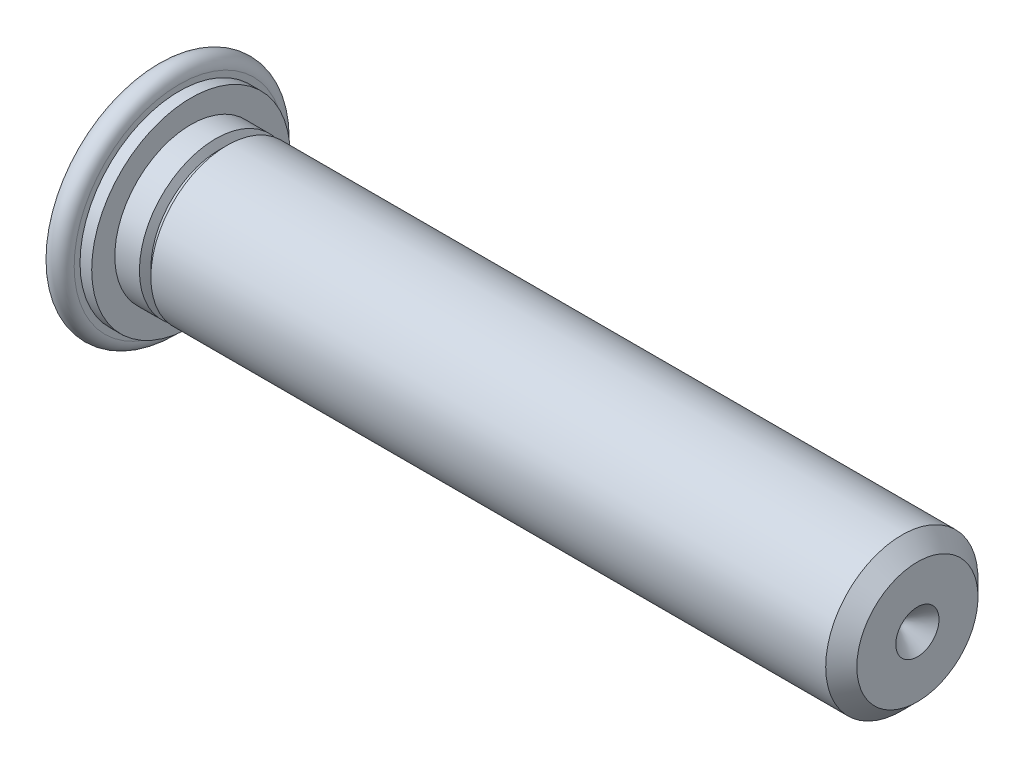
ISO-10303-21;
HEADER;
FILE_DESCRIPTION(('STEP AP214'),'2;1');
FILE_NAME('part.step','',(''),(''),'','','');
FILE_SCHEMA(('AUTOMOTIVE_DESIGN { 1 0 10303 214 1 1 1 1 }'));
ENDSEC;
DATA;
#1=APPLICATION_CONTEXT('core data for automotive mechanical design processes');
#2=APPLICATION_PROTOCOL_DEFINITION('international standard','automotive_design',2000,#1);
#3=PRODUCT_CONTEXT('',#1,'mechanical');
#4=PRODUCT('Part','Part','',(#3));
#5=PRODUCT_RELATED_PRODUCT_CATEGORY('part','',(#4));
#6=PRODUCT_DEFINITION_FORMATION('','',#4);
#7=PRODUCT_DEFINITION_CONTEXT('part definition',#1,'design');
#8=PRODUCT_DEFINITION('design','',#6,#7);
#9=PRODUCT_DEFINITION_SHAPE('','',#8);
#10=(LENGTH_UNIT() NAMED_UNIT(*) SI_UNIT(.MILLI.,.METRE.));
#11=(NAMED_UNIT(*) PLANE_ANGLE_UNIT() SI_UNIT($,.RADIAN.));
#12=(NAMED_UNIT(*) SI_UNIT($,.STERADIAN.) SOLID_ANGLE_UNIT());
#13=UNCERTAINTY_MEASURE_WITH_UNIT(LENGTH_MEASURE(1.E-05),#10,'distance_accuracy_value','');
#14=(GEOMETRIC_REPRESENTATION_CONTEXT(3) GLOBAL_UNCERTAINTY_ASSIGNED_CONTEXT((#13)) GLOBAL_UNIT_ASSIGNED_CONTEXT((#10,
#11,#12)) REPRESENTATION_CONTEXT('',''));
#15=CARTESIAN_POINT('',(0.,0.,0.));
#16=DIRECTION('',(0.,0.,1.));
#17=DIRECTION('',(1.,0.,0.));
#18=AXIS2_PLACEMENT_3D('',#15,#16,#17);
#19=CARTESIAN_POINT('',(15.0000081,0.,0.));
#20=DIRECTION('',(1.,0.,0.));
#21=DIRECTION('',(0.,0.,-1.));
#22=AXIS2_PLACEMENT_3D('',#19,#20,#21);
#23=CONICAL_SURFACE('',#22,0.42550022977,0.785398163397452);
#24=CARTESIAN_POINT('',(14.57450787023,0.,0.));
#25=VERTEX_POINT('',#24);
#26=VERTEX_LOOP('',#25);
#27=FACE_BOUND('',#26,.T.);
#28=CARTESIAN_POINT('',(15.0000081,0.,0.));
#29=DIRECTION('',(1.,0.,0.));
#30=DIRECTION('',(0.,0.,-1.));
#31=AXIS2_PLACEMENT_3D('',#28,#29,#30);
#32=CIRCLE('',#31,0.425500229769999);
#33=CARTESIAN_POINT('',(15.0000081,0.,-0.425500229769999));
#34=VERTEX_POINT('',#33);
#35=EDGE_CURVE('E20',#34,#34,#32,.F.);
#36=ORIENTED_EDGE('',*,*,#35,.F.);
#37=EDGE_LOOP('',(#36));
#38=FACE_BOUND('',#37,.T.);
#39=ADVANCED_FACE('F16',(#27,#38),#23,.F.);
#40=CARTESIAN_POINT('',(15.0000081,-1.2173706573798,1.19350064449));
#41=DIRECTION('',(1.,0.,0.));
#42=DIRECTION('',(0.,0.,-1.));
#43=AXIS2_PLACEMENT_3D('',#40,#41,#42);
#44=PLANE('',#43);
#45=CARTESIAN_POINT('',(15.0000081,0.,0.));
#46=DIRECTION('',(-1.,0.,0.));
#47=DIRECTION('',(0.,0.,1.));
#48=AXIS2_PLACEMENT_3D('',#45,#46,#47);
#49=CIRCLE('',#48,1.19350064449);
#50=CARTESIAN_POINT('',(15.0000081,0.,1.19350064449));
#51=VERTEX_POINT('',#50);
#52=EDGE_CURVE('E35',#51,#51,#49,.T.);
#53=ORIENTED_EDGE('',*,*,#52,.F.);
#54=EDGE_LOOP('',(#53));
#55=FACE_BOUND('',#54,.T.);
#56=ORIENTED_EDGE('',*,*,#35,.T.);
#57=EDGE_LOOP('',(#56));
#58=FACE_BOUND('',#57,.T.);
#59=ADVANCED_FACE('F30',(#55,#58),#44,.T.);
#60=CARTESIAN_POINT('',(14.69350793449,0.,0.));
#61=DIRECTION('',(-1.,0.,0.));
#62=DIRECTION('',(0.,0.,1.));
#63=AXIS2_PLACEMENT_3D('',#60,#61,#62);
#64=CONICAL_SURFACE('',#63,1.50000081,0.785398163397452);
#65=CARTESIAN_POINT('',(14.69350793449,0.,0.));
#66=DIRECTION('',(-1.,0.,0.));
#67=DIRECTION('',(0.,0.,1.));
#68=AXIS2_PLACEMENT_3D('',#65,#66,#67);
#69=CIRCLE('',#68,1.50000081);
#70=CARTESIAN_POINT('',(14.69350793449,0.,1.50000081));
#71=VERTEX_POINT('',#70);
#72=EDGE_CURVE('E37',#71,#71,#69,.T.);
#73=ORIENTED_EDGE('',*,*,#72,.F.);
#74=EDGE_LOOP('',(#73));
#75=FACE_BOUND('',#74,.T.);
#76=ORIENTED_EDGE('',*,*,#52,.T.);
#77=EDGE_LOOP('',(#76));
#78=FACE_BOUND('',#77,.T.);
#79=ADVANCED_FACE('F149',(#75,#78),#64,.T.);
#80=CARTESIAN_POINT('',(1.400000756,0.,0.));
#81=DIRECTION('',(1.,0.,0.));
#82=DIRECTION('',(0.,0.,-1.));
#83=AXIS2_PLACEMENT_3D('',#80,#81,#82);
#84=CYLINDRICAL_SURFACE('',#83,1.50000081);
#85=CARTESIAN_POINT('',(1.400000756,0.,0.));
#86=DIRECTION('',(-1.,0.,0.));
#87=DIRECTION('',(0.,0.,1.));
#88=AXIS2_PLACEMENT_3D('',#85,#86,#87);
#89=CIRCLE('',#88,1.50000081);
#90=CARTESIAN_POINT('',(1.400000756,0.,1.50000081));
#91=VERTEX_POINT('',#90);
#92=EDGE_CURVE('E41',#91,#91,#89,.T.);
#93=ORIENTED_EDGE('',*,*,#92,.F.);
#94=EDGE_LOOP('',(#93));
#95=FACE_BOUND('',#94,.T.);
#96=ORIENTED_EDGE('',*,*,#72,.T.);
#97=EDGE_LOOP('',(#96));
#98=FACE_BOUND('',#97,.T.);
#99=ADVANCED_FACE('F141',(#95,#98),#84,.T.);
#100=CARTESIAN_POINT('',(1.3250007155,0.,0.));
#101=DIRECTION('',(1.,0.,0.));
#102=DIRECTION('',(0.,0.,-1.));
#103=AXIS2_PLACEMENT_3D('',#100,#101,#102);
#104=CONICAL_SURFACE('',#103,1.350000729,1.10714871779409);
#105=ORIENTED_EDGE('',*,*,#92,.T.);
#106=EDGE_LOOP('',(#105));
#107=FACE_BOUND('',#106,.T.);
#108=CARTESIAN_POINT('',(1.32500071545227,0.,0.));
#109=DIRECTION('',(-1.,0.,0.));
#110=DIRECTION('',(0.,0.,1.));
#111=AXIS2_PLACEMENT_3D('',#108,#109,#110);
#112=CIRCLE('',#111,1.35000072908788);
#113=CARTESIAN_POINT('',(1.32500071545227,0.,1.35000072908788));
#114=VERTEX_POINT('',#113);
#115=EDGE_CURVE('E48',#114,#114,#112,.T.);
#116=ORIENTED_EDGE('',*,*,#115,.F.);
#117=EDGE_LOOP('',(#116));
#118=FACE_BOUND('',#117,.T.);
#119=ADVANCED_FACE('F133',(#107,#118),#104,.T.);
#120=CARTESIAN_POINT('',(0.,-2.111401140156,-2.0700011178));
#121=DIRECTION('',(-1.,0.,0.));
#122=DIRECTION('',(0.,0.,1.));
#123=AXIS2_PLACEMENT_3D('',#120,#121,#122);
#124=PLANE('',#123);
#125=CARTESIAN_POINT('',(0.,0.,0.));
#126=DIRECTION('',(1.,0.,0.));
#127=DIRECTION('',(0.,0.,-1.));
#128=AXIS2_PLACEMENT_3D('',#125,#126,#127);
#129=CIRCLE('',#128,2.0700079001343);
#130=CARTESIAN_POINT('',(0.,0.,-2.0700079001343));
#131=VERTEX_POINT('',#130);
#132=EDGE_CURVE('E44',#131,#131,#129,.T.);
#133=ORIENTED_EDGE('',*,*,#132,.F.);
#134=EDGE_LOOP('',(#133));
#135=FACE_BOUND('',#134,.T.);
#136=ADVANCED_FACE('F82',(#135),#124,.T.);
#137=CARTESIAN_POINT('',(1.28750069525,0.,0.));
#138=DIRECTION('',(1.,0.,0.));
#139=DIRECTION('',(0.,0.,-1.));
#140=AXIS2_PLACEMENT_3D('',#137,#138,#139);
#141=TOROIDAL_SURFACE('',#140,1.4149526694733,0.0750000404999998);
#142=ORIENTED_EDGE('',*,*,#115,.T.);
#143=EDGE_LOOP('',(#142));
#144=FACE_BOUND('',#143,.T.);
#145=CARTESIAN_POINT('',(1.25000067501268,0.,0.));
#146=DIRECTION('',(-1.,0.,0.));
#147=DIRECTION('',(0.,0.,1.));
#148=AXIS2_PLACEMENT_3D('',#145,#146,#147);
#149=CIRCLE('',#148,1.35000072906794);
#150=CARTESIAN_POINT('',(1.25000067501268,0.,1.35000072906794));
#151=VERTEX_POINT('',#150);
#152=EDGE_CURVE('E47',#151,#151,#149,.T.);
#153=ORIENTED_EDGE('',*,*,#152,.F.);
#154=EDGE_LOOP('',(#153));
#155=FACE_BOUND('',#154,.T.);
#156=ADVANCED_FACE('F72',(#144,#155),#141,.F.);
#157=CARTESIAN_POINT('',(1.1750006345373,0.,0.));
#158=DIRECTION('',(-1.,0.,0.));
#159=DIRECTION('',(0.,0.,1.));
#160=AXIS2_PLACEMENT_3D('',#157,#158,#159);
#161=CONICAL_SURFACE('',#160,1.5000008100187,1.10714871779409);
#162=ORIENTED_EDGE('',*,*,#152,.T.);
#163=EDGE_LOOP('',(#162));
#164=FACE_BOUND('',#163,.T.);
#165=CARTESIAN_POINT('',(1.1750006345467,0.,0.));
#166=DIRECTION('',(-1.,0.,0.));
#167=DIRECTION('',(0.,0.,1.));
#168=AXIS2_PLACEMENT_3D('',#165,#166,#167);
#169=CIRCLE('',#168,1.50000081);
#170=CARTESIAN_POINT('',(1.1750006345467,0.,1.50000081));
#171=VERTEX_POINT('',#170);
#172=EDGE_CURVE('E53',#171,#171,#169,.T.);
#173=ORIENTED_EDGE('',*,*,#172,.F.);
#174=EDGE_LOOP('',(#173));
#175=FACE_BOUND('',#174,.T.);
#176=ADVANCED_FACE('F69',(#164,#175),#161,.T.);
#177=CARTESIAN_POINT('',(0.2300001242,0.,0.));
#178=DIRECTION('',(1.,0.,0.));
#179=DIRECTION('',(0.,0.,-1.));
#180=AXIS2_PLACEMENT_3D('',#177,#178,#179);
#181=TOROIDAL_SURFACE('',#180,2.0700079001343,0.2300001242);
#182=ORIENTED_EDGE('',*,*,#132,.T.);
#183=EDGE_LOOP('',(#182));
#184=FACE_BOUND('',#183,.T.);
#185=CARTESIAN_POINT('',(0.4600002483,0.,0.));
#186=DIRECTION('',(1.,0.,0.));
#187=DIRECTION('',(0.,0.,-1.));
#188=AXIS2_PLACEMENT_3D('',#185,#186,#187);
#189=CIRCLE('',#188,2.0700011178);
#190=CARTESIAN_POINT('',(0.4600002483,0.,-2.0700011178));
#191=VERTEX_POINT('',#190);
#192=EDGE_CURVE('E49',#191,#191,#189,.T.);
#193=ORIENTED_EDGE('',*,*,#192,.F.);
#194=EDGE_LOOP('',(#193));
#195=FACE_BOUND('',#194,.T.);
#196=ADVANCED_FACE('F71',(#184,#195),#181,.T.);
#197=CARTESIAN_POINT('',(0.6900003726,0.,0.));
#198=DIRECTION('',(1.,0.,0.));
#199=DIRECTION('',(0.,0.,-1.));
#200=AXIS2_PLACEMENT_3D('',#197,#198,#199);
#201=CYLINDRICAL_SURFACE('',#200,1.50000081);
#202=CARTESIAN_POINT('',(0.6900003726,0.,0.));
#203=DIRECTION('',(1.,0.,0.));
#204=DIRECTION('',(0.,0.,-1.));
#205=AXIS2_PLACEMENT_3D('',#202,#203,#204);
#206=CIRCLE('',#205,1.50000081);
#207=CARTESIAN_POINT('',(0.6900003726,0.,-1.50000081));
#208=VERTEX_POINT('',#207);
#209=EDGE_CURVE('E52',#208,#208,#206,.F.);
#210=ORIENTED_EDGE('',*,*,#209,.F.);
#211=EDGE_LOOP('',(#210));
#212=FACE_BOUND('',#211,.T.);
#213=ORIENTED_EDGE('',*,*,#172,.T.);
#214=EDGE_LOOP('',(#213));
#215=FACE_BOUND('',#214,.T.);
#216=ADVANCED_FACE('F67',(#212,#215),#201,.T.);
#217=CARTESIAN_POINT('',(0.46000024835,-2.111401140156,2.0700011178));
#218=DIRECTION('',(1.,0.,0.));
#219=DIRECTION('',(0.,0.,-1.));
#220=AXIS2_PLACEMENT_3D('',#217,#218,#219);
#221=PLANE('',#220);
#222=CARTESIAN_POINT('',(0.46000024835,0.,0.));
#223=DIRECTION('',(-1.,0.,0.));
#224=DIRECTION('',(0.,0.,1.));
#225=AXIS2_PLACEMENT_3D('',#222,#223,#224);
#226=CIRCLE('',#225,1.9550010557);
#227=CARTESIAN_POINT('',(0.46000024835,0.,1.9550010557));
#228=VERTEX_POINT('',#227);
#229=EDGE_CURVE('E24',#228,#228,#226,.F.);
#230=ORIENTED_EDGE('',*,*,#229,.F.);
#231=EDGE_LOOP('',(#230));
#232=FACE_BOUND('',#231,.T.);
#233=ORIENTED_EDGE('',*,*,#192,.T.);
#234=EDGE_LOOP('',(#233));
#235=FACE_BOUND('',#234,.T.);
#236=ADVANCED_FACE('F91',(#232,#235),#221,.T.);
#237=CARTESIAN_POINT('',(0.6900003726,1.994101076814,-1.9550010557));
#238=DIRECTION('',(1.,0.,0.));
#239=DIRECTION('',(0.,0.,1.));
#240=AXIS2_PLACEMENT_3D('',#237,#238,#239);
#241=PLANE('',#240);
#242=CARTESIAN_POINT('',(0.6900003726,0.,0.));
#243=DIRECTION('',(-1.,0.,0.));
#244=DIRECTION('',(0.,0.,1.));
#245=AXIS2_PLACEMENT_3D('',#242,#243,#244);
#246=CIRCLE('',#245,1.9550010557);
#247=CARTESIAN_POINT('',(0.6900003726,0.,1.9550010557));
#248=VERTEX_POINT('',#247);
#249=EDGE_CURVE('E10',#248,#248,#246,.T.);
#250=ORIENTED_EDGE('',*,*,#249,.F.);
#251=EDGE_LOOP('',(#250));
#252=FACE_BOUND('',#251,.T.);
#253=ORIENTED_EDGE('',*,*,#209,.T.);
#254=EDGE_LOOP('',(#253));
#255=FACE_BOUND('',#254,.T.);
#256=ADVANCED_FACE('F86',(#252,#255),#241,.T.);
#257=CARTESIAN_POINT('',(0.6900003726,0.,0.));
#258=DIRECTION('',(-1.,0.,0.));
#259=DIRECTION('',(0.,0.,1.));
#260=AXIS2_PLACEMENT_3D('',#257,#258,#259);
#261=CYLINDRICAL_SURFACE('',#260,1.9550010557);
#262=ORIENTED_EDGE('',*,*,#249,.T.);
#263=EDGE_LOOP('',(#262));
#264=FACE_BOUND('',#263,.T.);
#265=ORIENTED_EDGE('',*,*,#229,.T.);
#266=EDGE_LOOP('',(#265));
#267=FACE_BOUND('',#266,.T.);
#268=ADVANCED_FACE('F18',(#264,#267),#261,.T.);
#269=CLOSED_SHELL('',(#39,#59,#79,#99,#119,#136,#156,#176,#196,#216,#236,#256,#268));
#270=MANIFOLD_SOLID_BREP('B1',#269);
#271=ADVANCED_BREP_SHAPE_REPRESENTATION('',(#18,#270),#14);
#272=SHAPE_DEFINITION_REPRESENTATION(#9,#271);
ENDSEC;
END-ISO-10303-21;
